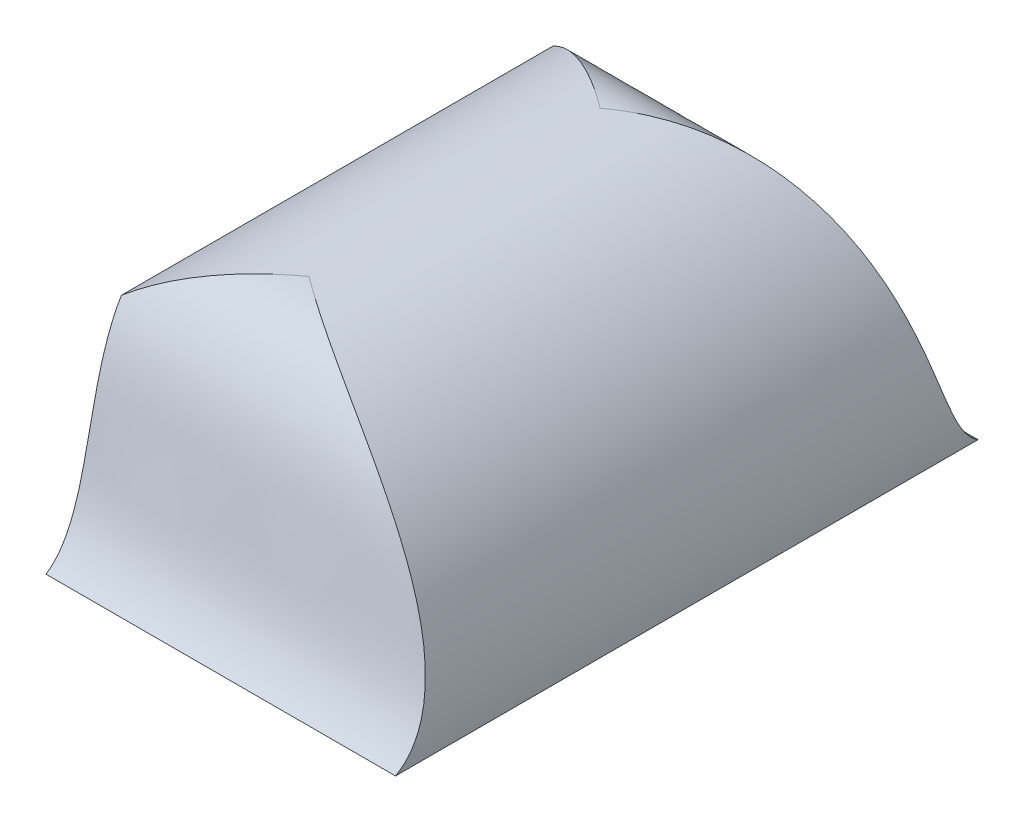
ISO-10303-21;
HEADER;
FILE_DESCRIPTION(('STEP AP214'),'2;1');
FILE_NAME('part.step','',(''),(''),'','','');
FILE_SCHEMA(('AUTOMOTIVE_DESIGN { 1 0 10303 214 1 1 1 1 }'));
ENDSEC;
DATA;
#1=APPLICATION_CONTEXT('core data for automotive mechanical design processes');
#2=APPLICATION_PROTOCOL_DEFINITION('international standard','automotive_design',2000,#1);
#3=PRODUCT_CONTEXT('',#1,'mechanical');
#4=PRODUCT('Part','Part','',(#3));
#5=PRODUCT_RELATED_PRODUCT_CATEGORY('part','',(#4));
#6=PRODUCT_DEFINITION_FORMATION('','',#4);
#7=PRODUCT_DEFINITION_CONTEXT('part definition',#1,'design');
#8=PRODUCT_DEFINITION('design','',#6,#7);
#9=PRODUCT_DEFINITION_SHAPE('','',#8);
#10=(LENGTH_UNIT() NAMED_UNIT(*) SI_UNIT(.MILLI.,.METRE.));
#11=(NAMED_UNIT(*) PLANE_ANGLE_UNIT() SI_UNIT($,.RADIAN.));
#12=(NAMED_UNIT(*) SI_UNIT($,.STERADIAN.) SOLID_ANGLE_UNIT());
#13=UNCERTAINTY_MEASURE_WITH_UNIT(LENGTH_MEASURE(1.E-05),#10,'distance_accuracy_value','');
#14=(GEOMETRIC_REPRESENTATION_CONTEXT(3) GLOBAL_UNCERTAINTY_ASSIGNED_CONTEXT((#13)) GLOBAL_UNIT_ASSIGNED_CONTEXT((#10,
#11,#12)) REPRESENTATION_CONTEXT('',''));
#15=CARTESIAN_POINT('',(0.,0.,0.));
#16=DIRECTION('',(0.,0.,1.));
#17=DIRECTION('',(1.,0.,0.));
#18=AXIS2_PLACEMENT_3D('',#15,#16,#17);
#19=CARTESIAN_POINT('',(0.6,0.,0.25));
#20=CARTESIAN_POINT('',(0.626819788030723,0.289928397578695,0.25));
#21=CARTESIAN_POINT('',(0.257985515738042,0.545390799762338,0.25));
#22=CARTESIAN_POINT('',(0.,0.35,0.25));
#23=B_SPLINE_CURVE_WITH_KNOTS('',3,(#19,#20,#21,#22),.UNSPECIFIED.,.F.,.F.,(4,4),(0.,1.),.UNSPECIFIED.);
#24=DIRECTION('',(0.,0.,-1.));
#25=VECTOR('',#24,1.);
#26=SURFACE_OF_LINEAR_EXTRUSION('',#23,#25);
#27=DIRECTION('',(0.,0.,-1.));
#28=VECTOR('',#27,1.);
#29=CARTESIAN_POINT('',(0.,0.35,0.25));
#30=LINE('',#29,#28);
#31=CARTESIAN_POINT('',(0.,0.349999999403882,0.370521911412625));
#32=VERTEX_POINT('',#31);
#33=CARTESIAN_POINT('',(0.,0.35,-0.370521911412625));
#34=VERTEX_POINT('',#33);
#35=EDGE_CURVE('E46',#32,#34,#30,.T.);
#36=ORIENTED_EDGE('',*,*,#35,.F.);
#37=CARTESIAN_POINT('',(0.,0.349999999999997,0.370521911049339));
#38=CARTESIAN_POINT('',(0.00825527885618861,0.356255849450693,0.366712872777325));
#39=CARTESIAN_POINT('',(0.01670774569311,0.362105432406488,0.362678678142125));
#40=CARTESIAN_POINT('',(0.0339234244274184,0.372950656876308,0.354163679151032));
#41=CARTESIAN_POINT('',(0.0426864991470208,0.377946669826716,0.349683070405773));
#42=CARTESIAN_POINT('',(0.0692006872566339,0.391535029749839,0.335639015499935));
#43=CARTESIAN_POINT('',(0.0872968181289452,0.398817946316962,0.325418908973627));
#44=CARTESIAN_POINT('',(0.121098640930965,0.409136187235741,0.305036802703458));
#45=CARTESIAN_POINT('',(0.136788344406358,0.412620049119834,0.29506273608286));
#46=CARTESIAN_POINT('',(0.167911899364637,0.417252919245855,0.274235900732327));
#47=CARTESIAN_POINT('',(0.183345927724373,0.418403614738341,0.263383772890552));
#48=CARTESIAN_POINT('',(0.199505616780379,0.418544612505018,0.251466641467701));
#49=CARTESIAN_POINT('',(0.2004959868034,0.418548912358348,0.250734018721069));
#50=CARTESIAN_POINT('',(0.20148518074984,0.418548901834156,0.25));
#51=B_SPLINE_CURVE_WITH_KNOTS('',3,(#37,#38,#39,#40,#41,#42,#43,#44,#45,#46,#47,#48,#49,#50),
.UNSPECIFIED.,.F.,.F.,(4,2,2,2,2,2,4),(0.,0.0330862202839932,0.0661580060149827,
0.131829646521694,0.188407274208213,0.244943972653786,0.248639634344501),.UNSPECIFIED.);
#52=CARTESIAN_POINT('',(0.201485180749996,0.418548901834156,0.25));
#53=VERTEX_POINT('',#52);
#54=EDGE_CURVE('E75',#32,#53,#51,.T.);
#55=ORIENTED_EDGE('',*,*,#54,.T.);
#56=CARTESIAN_POINT('',(0.6,0.,0.5));
#57=CARTESIAN_POINT('',(0.600309456843271,0.00328595093172608,0.494965112052997));
#58=CARTESIAN_POINT('',(0.600610500159222,0.00713623887497123,0.490374210968532));
#59=CARTESIAN_POINT('',(0.601089507162062,0.0155632954519763,0.482064447642185));
#60=CARTESIAN_POINT('',(0.601269609789353,0.0201255775204056,0.47833124373096));
#61=CARTESIAN_POINT('',(0.601454954538251,0.0320253042292035,0.469911865294647));
#62=CARTESIAN_POINT('',(0.601334354444628,0.0396417637507074,0.465631526865669));
#63=CARTESIAN_POINT('',(0.600497506607325,0.0553849172072791,0.458063979399536));
#64=CARTESIAN_POINT('',(0.599775335927399,0.0635159388713859,0.454787090636494));
#65=CARTESIAN_POINT('',(0.596748385181316,0.0872787410461483,0.446276502410716));
#66=CARTESIAN_POINT('',(0.593605748882381,0.103113037235993,0.441914948246667));
#67=CARTESIAN_POINT('',(0.5850967919933,0.134370708740922,0.43422445179017));
#68=CARTESIAN_POINT('',(0.579731364935154,0.149794246526878,0.430895095507223));
#69=CARTESIAN_POINT('',(0.564450389619757,0.185923664821895,0.423273653674747));
#70=CARTESIAN_POINT('',(0.553572727417092,0.206259340928663,0.419132877391412));
#71=CARTESIAN_POINT('',(0.528627154892707,0.244755632950418,0.410362891631758));
#72=CARTESIAN_POINT('',(0.514555513806971,0.262913667032004,0.405733114380721));
#73=CARTESIAN_POINT('',(0.483760308356701,0.296816735105153,0.395298023187908));
#74=CARTESIAN_POINT('',(0.467009350638104,0.312533119150924,0.389480372983261));
#75=CARTESIAN_POINT('',(0.431674713054268,0.34095582958504,0.376272103483193));
#76=CARTESIAN_POINT('',(0.413091112238233,0.353662285723215,0.368881552017362));
#77=CARTESIAN_POINT('',(0.37410456686757,0.37618621593128,0.351965538274795));
#78=CARTESIAN_POINT('',(0.353659961186571,0.385881205949137,0.342371952666841));
#79=CARTESIAN_POINT('',(0.312432573313025,0.401528263512743,0.321154569651431));
#80=CARTESIAN_POINT('',(0.291650113315865,0.407483704514568,0.309532614173704));
#81=CARTESIAN_POINT('',(0.248455423708947,0.416086356109303,0.283111456839611));
#82=CARTESIAN_POINT('',(0.226085830064731,0.418347151703636,0.268111510903899));
#83=CARTESIAN_POINT('',(0.203465071608549,0.418544642715857,0.251466128242887));
#84=CARTESIAN_POINT('',(0.202474322305935,0.418548944688426,0.250734015315585));
#85=CARTESIAN_POINT('',(0.20148518074984,0.418548901834156,0.25));
#86=B_SPLINE_CURVE_WITH_KNOTS('',3,(#56,#57,#58,#59,#60,#61,#62,#63,#64,#65,#66,#67,#68,#69,#70,
#71,#72,#73,#74,#75,#76,#77,#78,#79,#80,#81,#82,#83,#84,#85),.UNSPECIFIED.,.F.,.F.,(4,2,2,2,2,2,
2,2,2,2,2,2,2,2,4),(0.,0.0179271297373814,0.0355282081543646,0.0615987211301575,
0.0879289952653558,0.137815573256445,0.187682116942603,0.257603420179295,0.327606819977274,
0.398378012167399,0.469146153047947,0.542499334026183,0.615786247498508,0.696337234710239,
0.700032899617386),.UNSPECIFIED.);
#87=CARTESIAN_POINT('',(0.6,0.,0.5));
#88=VERTEX_POINT('',#87);
#89=EDGE_CURVE('E77',#53,#88,#86,.F.);
#90=ORIENTED_EDGE('',*,*,#89,.T.);
#91=DIRECTION('',(0.,0.,-1.));
#92=VECTOR('',#91,1.);
#93=CARTESIAN_POINT('',(0.6,0.,0.25));
#94=LINE('',#93,#92);
#95=CARTESIAN_POINT('',(0.6,0.,-0.5));
#96=VERTEX_POINT('',#95);
#97=EDGE_CURVE('E87',#88,#96,#94,.T.);
#98=ORIENTED_EDGE('',*,*,#97,.T.);
#99=CARTESIAN_POINT('',(0.6,0.,-0.5));
#100=CARTESIAN_POINT('',(0.600309456843271,0.00328595093172607,-0.494965112052997));
#101=CARTESIAN_POINT('',(0.600610500159222,0.00713623887497124,-0.490374210968532));
#102=CARTESIAN_POINT('',(0.601089507162062,0.0155632954519763,-0.482064447642185));
#103=CARTESIAN_POINT('',(0.601269609789353,0.0201255775204056,-0.47833124373096));
#104=CARTESIAN_POINT('',(0.601454954538251,0.0320253042292035,-0.469911865294647));
#105=CARTESIAN_POINT('',(0.601334354444628,0.0396417637507074,-0.465631526865669));
#106=CARTESIAN_POINT('',(0.600497506607325,0.0553849172072791,-0.458063979399536));
#107=CARTESIAN_POINT('',(0.5997753359274,0.0635159388713859,-0.454787090636494));
#108=CARTESIAN_POINT('',(0.596748385181316,0.0872787410461483,-0.446276502410716));
#109=CARTESIAN_POINT('',(0.593605748882381,0.103113037235993,-0.441914948246667));
#110=CARTESIAN_POINT('',(0.585096791993299,0.134370708740922,-0.43422445179017));
#111=CARTESIAN_POINT('',(0.579731364935154,0.149794246526878,-0.430895095507223));
#112=CARTESIAN_POINT('',(0.564450389619757,0.185923664821896,-0.423273653674747));
#113=CARTESIAN_POINT('',(0.553572727417092,0.206259340928664,-0.419132877391411));
#114=CARTESIAN_POINT('',(0.528627154892706,0.244755632950419,-0.410362891631758));
#115=CARTESIAN_POINT('',(0.51455551380697,0.262913667032004,-0.40573311438072));
#116=CARTESIAN_POINT('',(0.4837603083567,0.296816735105154,-0.395298023187908));
#117=CARTESIAN_POINT('',(0.467009350638103,0.312533119150925,-0.389480372983261));
#118=CARTESIAN_POINT('',(0.431674713054267,0.340955829585041,-0.376272103483192));
#119=CARTESIAN_POINT('',(0.413091112238231,0.353662285723216,-0.368881552017362));
#120=CARTESIAN_POINT('',(0.374104566867568,0.376186215931281,-0.351965538274795));
#121=CARTESIAN_POINT('',(0.353659961186569,0.385881205949137,-0.342371952666839));
#122=CARTESIAN_POINT('',(0.312432573313022,0.401528263512743,-0.321154569651431));
#123=CARTESIAN_POINT('',(0.291650113315862,0.407483704514568,-0.309532614173706));
#124=CARTESIAN_POINT('',(0.248455423708948,0.416086356109303,-0.283111456839608));
#125=CARTESIAN_POINT('',(0.226085830064738,0.418347151703636,-0.268111510903888));
#126=CARTESIAN_POINT('',(0.203465071608549,0.418544642715857,-0.251466128242886));
#127=CARTESIAN_POINT('',(0.202474322305935,0.418548944688426,-0.250734015315584));
#128=CARTESIAN_POINT('',(0.20148518074984,0.418548901834156,-0.25));
#129=B_SPLINE_CURVE_WITH_KNOTS('',3,(#99,#100,#101,#102,#103,#104,#105,#106,#107,#108,#109,#110,
#111,#112,#113,#114,#115,#116,#117,#118,#119,#120,#121,#122,#123,#124,#125,#126,#127,#128),
.UNSPECIFIED.,.F.,.F.,(4,2,2,2,2,2,2,2,2,2,2,2,2,2,4),(0.,0.0179271297373815,0.0355282081543646,
0.0615987211301575,0.0879289952653557,0.137815573256446,0.187682116942604,0.257603420179296,
0.327606819977276,0.3983780121674,0.469146153047948,0.542499334026186,0.615786247498509,
0.696337234710239,0.700032899617385),.UNSPECIFIED.);
#130=CARTESIAN_POINT('',(0.201486085555685,0.418548901832957,-0.25));
#131=VERTEX_POINT('',#130);
#132=EDGE_CURVE('E119',#131,#96,#129,.F.);
#133=ORIENTED_EDGE('',*,*,#132,.F.);
#134=CARTESIAN_POINT('',(0.,0.349999999999997,-0.370521911049339));
#135=CARTESIAN_POINT('',(0.00825527885619393,0.356255849450697,-0.366712872777322));
#136=CARTESIAN_POINT('',(0.0167077456931216,0.362105432406496,-0.362678678142119));
#137=CARTESIAN_POINT('',(0.0339234244274423,0.372950656876322,-0.354163679151021));
#138=CARTESIAN_POINT('',(0.0426864991470509,0.377946669826733,-0.349683070405758));
#139=CARTESIAN_POINT('',(0.0692006872566738,0.391535029749857,-0.335639015499912));
#140=CARTESIAN_POINT('',(0.087296818128987,0.398817946316979,-0.325418908973595));
#141=CARTESIAN_POINT('',(0.121098640931009,0.409136187235751,-0.305036802703437));
#142=CARTESIAN_POINT('',(0.136788344406402,0.412620049119839,-0.295062736082856));
#143=CARTESIAN_POINT('',(0.16791189936464,0.417252919245856,-0.2742359007323));
#144=CARTESIAN_POINT('',(0.183345927724335,0.418403614738342,-0.263383772890485));
#145=CARTESIAN_POINT('',(0.199505616780374,0.418544612505018,-0.251466641467692));
#146=CARTESIAN_POINT('',(0.200495986803397,0.418548912358348,-0.250734018721065));
#147=CARTESIAN_POINT('',(0.20148518074984,0.418548901834156,-0.25));
#148=B_SPLINE_CURVE_WITH_KNOTS('',3,(#134,#135,#136,#137,#138,#139,#140,#141,#142,#143,#144,
#145,#146,#147),.UNSPECIFIED.,.F.,.F.,(4,2,2,2,2,2,4),(0.,0.0330862202840161,0.0661580060150272,
0.131829646521755,0.18840727420824,0.244943972653787,0.2486396343445),.UNSPECIFIED.);
#149=EDGE_CURVE('E11',#34,#131,#148,.T.);
#150=ORIENTED_EDGE('',*,*,#149,.F.);
#151=EDGE_LOOP('',(#36,#55,#90,#98,#133,#150));
#152=FACE_BOUND('',#151,.T.);
#153=ADVANCED_FACE('F32',(#152),#26,.F.);
#154=CARTESIAN_POINT('',(0.,0.35,0.25));
#155=DIRECTION('',(1.,0.,0.));
#156=DIRECTION('',(0.,1.,0.));
#157=AXIS2_PLACEMENT_3D('',#154,#155,#156);
#158=PLANE('',#157);
#159=CARTESIAN_POINT('',(0.,0.,0.5));
#160=CARTESIAN_POINT('',(0.,0.0714905444473845,0.390864989579389));
#161=CARTESIAN_POINT('',(0.,0.418548901834156,0.458561006871926));
#162=CARTESIAN_POINT('',(0.,0.418548901834156,0.25));
#163=B_SPLINE_CURVE_WITH_KNOTS('',3,(#159,#160,#161,#162),.UNSPECIFIED.,.F.,.F.,(4,4),(0.,1.),.UNSPECIFIED.);
#164=CARTESIAN_POINT('',(0.,0.,0.5));
#165=VERTEX_POINT('',#164);
#166=EDGE_CURVE('E91',#165,#32,#163,.T.);
#167=ORIENTED_EDGE('',*,*,#166,.T.);
#168=ORIENTED_EDGE('',*,*,#35,.T.);
#169=CARTESIAN_POINT('',(0.,0.,-0.5));
#170=CARTESIAN_POINT('',(0.,0.0714905444473845,-0.390864989579389));
#171=CARTESIAN_POINT('',(0.,0.418548901834156,-0.458561006871926));
#172=CARTESIAN_POINT('',(0.,0.418548901834156,-0.25));
#173=B_SPLINE_CURVE_WITH_KNOTS('',3,(#169,#170,#171,#172),.UNSPECIFIED.,.F.,.F.,(4,4),(0.,1.),.UNSPECIFIED.);
#174=CARTESIAN_POINT('',(0.,0.,-0.5));
#175=VERTEX_POINT('',#174);
#176=EDGE_CURVE('E82',#175,#34,#173,.T.);
#177=ORIENTED_EDGE('',*,*,#176,.F.);
#178=DIRECTION('',(0.,0.,-1.));
#179=VECTOR('',#178,1.);
#180=CARTESIAN_POINT('',(0.,0.,0.25));
#181=LINE('',#180,#179);
#182=EDGE_CURVE('E89',#165,#175,#181,.T.);
#183=ORIENTED_EDGE('',*,*,#182,.F.);
#184=EDGE_LOOP('',(#167,#168,#177,#183));
#185=FACE_BOUND('',#184,.T.);
#186=ADVANCED_FACE('F140',(#185),#158,.F.);
#187=CARTESIAN_POINT('',(0.,0.,0.25));
#188=DIRECTION('',(0.,1.,0.));
#189=DIRECTION('',(0.,0.,1.));
#190=AXIS2_PLACEMENT_3D('',#187,#188,#189);
#191=PLANE('',#190);
#192=ORIENTED_EDGE('',*,*,#182,.T.);
#193=DIRECTION('',(-1.,0.,0.));
#194=VECTOR('',#193,1.);
#195=CARTESIAN_POINT('',(0.627446635869675,0.,-0.5));
#196=LINE('',#195,#194);
#197=EDGE_CURVE('E100',#96,#175,#196,.T.);
#198=ORIENTED_EDGE('',*,*,#197,.F.);
#199=ORIENTED_EDGE('',*,*,#97,.F.);
#200=DIRECTION('',(-1.,0.,0.));
#201=VECTOR('',#200,1.);
#202=CARTESIAN_POINT('',(0.614409894015362,0.,0.5));
#203=LINE('',#202,#201);
#204=EDGE_CURVE('E86',#88,#165,#203,.T.);
#205=ORIENTED_EDGE('',*,*,#204,.T.);
#206=EDGE_LOOP('',(#192,#198,#199,#205));
#207=FACE_BOUND('',#206,.T.);
#208=ADVANCED_FACE('F110',(#207),#191,.F.);
#209=CARTESIAN_POINT('',(0.614409894015362,0.,0.5));
#210=CARTESIAN_POINT('',(0.614409894015362,0.0714905444473845,0.390864989579389));
#211=CARTESIAN_POINT('',(0.614409894015362,0.418548901834156,0.458561006871926));
#212=CARTESIAN_POINT('',(0.614409894015362,0.418548901834156,0.25));
#213=B_SPLINE_CURVE_WITH_KNOTS('',3,(#209,#210,#211,#212),.UNSPECIFIED.,.F.,.F.,(4,4),(0.,1.),.UNSPECIFIED.);
#214=DIRECTION('',(-1.,0.,0.));
#215=VECTOR('',#214,1.);
#216=SURFACE_OF_LINEAR_EXTRUSION('',#213,#215);
#217=ORIENTED_EDGE('',*,*,#54,.F.);
#218=ORIENTED_EDGE('',*,*,#166,.F.);
#219=ORIENTED_EDGE('',*,*,#204,.F.);
#220=ORIENTED_EDGE('',*,*,#89,.F.);
#221=EDGE_LOOP('',(#217,#218,#219,#220));
#222=FACE_BOUND('',#221,.T.);
#223=ADVANCED_FACE('F84',(#222),#216,.T.);
#224=CARTESIAN_POINT('',(0.627446635869675,0.,-0.5));
#225=CARTESIAN_POINT('',(0.627446635869675,0.0714905444473845,-0.390864989579389));
#226=CARTESIAN_POINT('',(0.627446635869675,0.418548901834156,-0.458561006871926));
#227=CARTESIAN_POINT('',(0.627446635869675,0.418548901834156,-0.25));
#228=B_SPLINE_CURVE_WITH_KNOTS('',3,(#224,#225,#226,#227),.UNSPECIFIED.,.F.,.F.,(4,4),(0.,1.),.UNSPECIFIED.);
#229=DIRECTION('',(-1.,0.,0.));
#230=VECTOR('',#229,1.);
#231=SURFACE_OF_LINEAR_EXTRUSION('',#228,#230);
#232=ORIENTED_EDGE('',*,*,#176,.T.);
#233=ORIENTED_EDGE('',*,*,#149,.T.);
#234=ORIENTED_EDGE('',*,*,#132,.T.);
#235=ORIENTED_EDGE('',*,*,#197,.T.);
#236=EDGE_LOOP('',(#232,#233,#234,#235));
#237=FACE_BOUND('',#236,.T.);
#238=ADVANCED_FACE('F109',(#237),#231,.F.);
#239=CLOSED_SHELL('',(#153,#186,#208,#223,#238));
#240=MANIFOLD_SOLID_BREP('B2',#239);
#241=ADVANCED_BREP_SHAPE_REPRESENTATION('',(#18,#240),#14);
#242=SHAPE_DEFINITION_REPRESENTATION(#9,#241);
ENDSEC;
END-ISO-10303-21;
